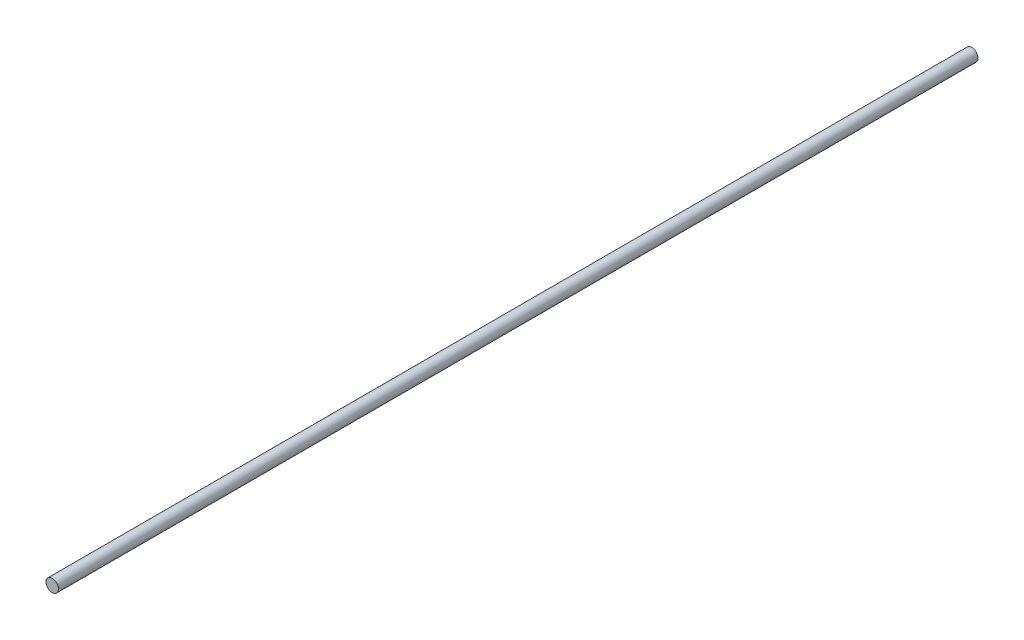
ISO-10303-21;
HEADER;
FILE_DESCRIPTION(('STEP AP214'),'2;1');
FILE_NAME('part.step','',(''),(''),'','','');
FILE_SCHEMA(('AUTOMOTIVE_DESIGN { 1 0 10303 214 1 1 1 1 }'));
ENDSEC;
DATA;
#1=APPLICATION_CONTEXT('core data for automotive mechanical design processes');
#2=APPLICATION_PROTOCOL_DEFINITION('international standard','automotive_design',2000,#1);
#3=PRODUCT_CONTEXT('',#1,'mechanical');
#4=PRODUCT('Part','Part','',(#3));
#5=PRODUCT_RELATED_PRODUCT_CATEGORY('part','',(#4));
#6=PRODUCT_DEFINITION_FORMATION('','',#4);
#7=PRODUCT_DEFINITION_CONTEXT('part definition',#1,'design');
#8=PRODUCT_DEFINITION('design','',#6,#7);
#9=PRODUCT_DEFINITION_SHAPE('','',#8);
#10=(LENGTH_UNIT() NAMED_UNIT(*) SI_UNIT(.MILLI.,.METRE.));
#11=(NAMED_UNIT(*) PLANE_ANGLE_UNIT() SI_UNIT($,.RADIAN.));
#12=(NAMED_UNIT(*) SI_UNIT($,.STERADIAN.) SOLID_ANGLE_UNIT());
#13=UNCERTAINTY_MEASURE_WITH_UNIT(LENGTH_MEASURE(1.E-05),#10,'distance_accuracy_value','');
#14=(GEOMETRIC_REPRESENTATION_CONTEXT(3) GLOBAL_UNCERTAINTY_ASSIGNED_CONTEXT((#13)) GLOBAL_UNIT_ASSIGNED_CONTEXT((#10,
#11,#12)) REPRESENTATION_CONTEXT('',''));
#15=CARTESIAN_POINT('',(0.,0.,0.));
#16=DIRECTION('',(0.,0.,1.));
#17=DIRECTION('',(1.,0.,0.));
#18=AXIS2_PLACEMENT_3D('',#15,#16,#17);
#19=CARTESIAN_POINT('',(0.,0.,590.));
#20=DIRECTION('',(0.,0.,-1.));
#21=DIRECTION('',(-1.,0.,0.));
#22=AXIS2_PLACEMENT_3D('',#19,#20,#21);
#23=CYLINDRICAL_SURFACE('',#22,4.);
#24=CARTESIAN_POINT('',(0.,0.,590.));
#25=DIRECTION('',(0.,0.,1.));
#26=DIRECTION('',(1.,0.,0.));
#27=AXIS2_PLACEMENT_3D('',#24,#25,#26);
#28=CIRCLE('',#27,4.);
#29=CARTESIAN_POINT('',(4.,0.,590.));
#30=VERTEX_POINT('',#29);
#31=EDGE_CURVE('E10',#30,#30,#28,.T.);
#32=ORIENTED_EDGE('',*,*,#31,.F.);
#33=EDGE_LOOP('',(#32));
#34=FACE_BOUND('',#33,.T.);
#35=CARTESIAN_POINT('',(0.,0.,0.));
#36=DIRECTION('',(0.,0.,1.));
#37=DIRECTION('',(1.,0.,0.));
#38=AXIS2_PLACEMENT_3D('',#35,#36,#37);
#39=CIRCLE('',#38,4.);
#40=CARTESIAN_POINT('',(4.,0.,0.));
#41=VERTEX_POINT('',#40);
#42=EDGE_CURVE('E34',#41,#41,#39,.T.);
#43=ORIENTED_EDGE('',*,*,#42,.T.);
#44=EDGE_LOOP('',(#43));
#45=FACE_BOUND('',#44,.T.);
#46=ADVANCED_FACE('F31',(#34,#45),#23,.T.);
#47=CARTESIAN_POINT('',(0.,0.,590.));
#48=DIRECTION('',(0.,0.,1.));
#49=DIRECTION('',(1.,0.,0.));
#50=AXIS2_PLACEMENT_3D('',#47,#48,#49);
#51=PLANE('',#50);
#52=ORIENTED_EDGE('',*,*,#31,.T.);
#53=EDGE_LOOP('',(#52));
#54=FACE_BOUND('',#53,.T.);
#55=ADVANCED_FACE('F46',(#54),#51,.T.);
#56=CARTESIAN_POINT('',(0.,0.,0.));
#57=DIRECTION('',(0.,0.,1.));
#58=DIRECTION('',(1.,0.,0.));
#59=AXIS2_PLACEMENT_3D('',#56,#57,#58);
#60=PLANE('',#59);
#61=ORIENTED_EDGE('',*,*,#42,.F.);
#62=EDGE_LOOP('',(#61));
#63=FACE_BOUND('',#62,.T.);
#64=ADVANCED_FACE('F44',(#63),#60,.F.);
#65=CLOSED_SHELL('',(#46,#55,#64));
#66=MANIFOLD_SOLID_BREP('B2',#65);
#67=ADVANCED_BREP_SHAPE_REPRESENTATION('',(#18,#66),#14);
#68=SHAPE_DEFINITION_REPRESENTATION(#9,#67);
ENDSEC;
END-ISO-10303-21;
